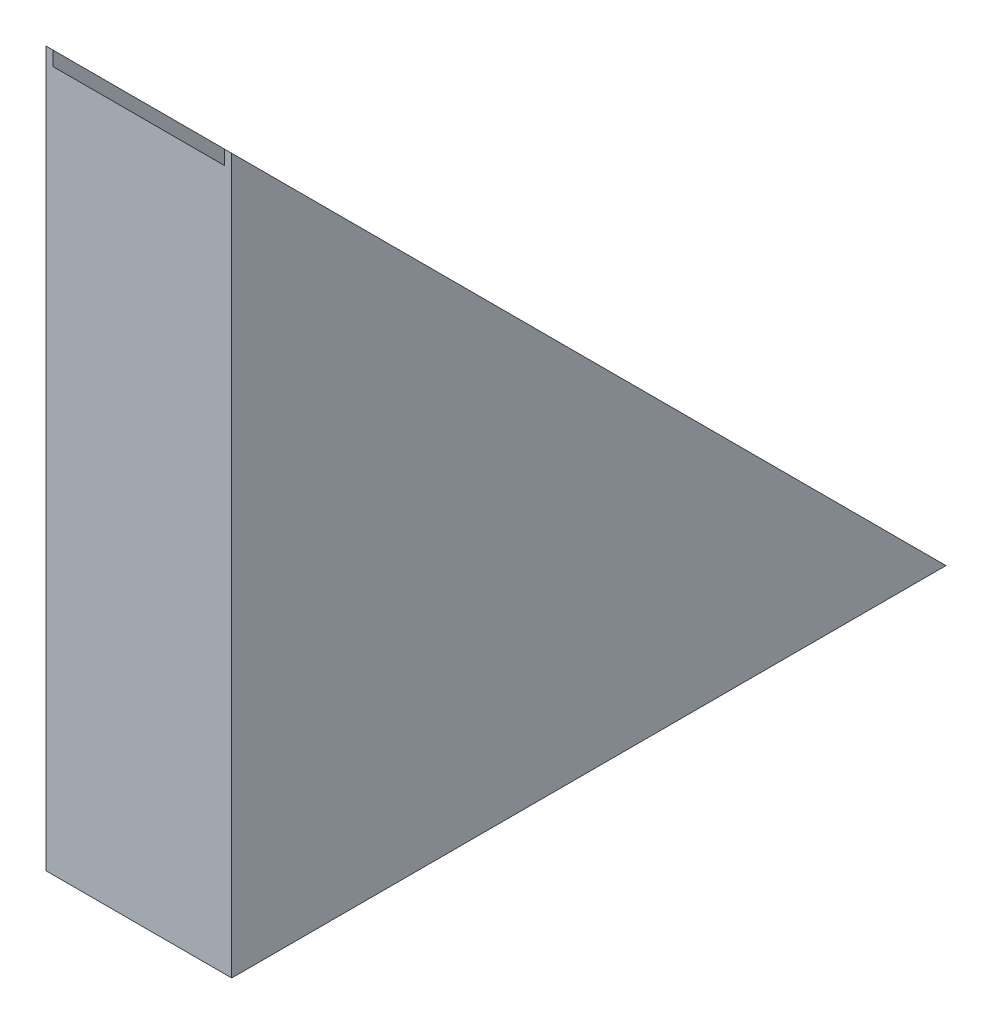
ISO-10303-21;
HEADER;
FILE_DESCRIPTION(('STEP AP214'),'2;1');
FILE_NAME('part.step','',(''),(''),'','','');
FILE_SCHEMA(('AUTOMOTIVE_DESIGN { 1 0 10303 214 1 1 1 1 }'));
ENDSEC;
DATA;
#1=APPLICATION_CONTEXT('core data for automotive mechanical design processes');
#2=APPLICATION_PROTOCOL_DEFINITION('international standard','automotive_design',2000,#1);
#3=PRODUCT_CONTEXT('',#1,'mechanical');
#4=PRODUCT('Part','Part','',(#3));
#5=PRODUCT_RELATED_PRODUCT_CATEGORY('part','',(#4));
#6=PRODUCT_DEFINITION_FORMATION('','',#4);
#7=PRODUCT_DEFINITION_CONTEXT('part definition',#1,'design');
#8=PRODUCT_DEFINITION('design','',#6,#7);
#9=PRODUCT_DEFINITION_SHAPE('','',#8);
#10=(LENGTH_UNIT() NAMED_UNIT(*) SI_UNIT(.MILLI.,.METRE.));
#11=(NAMED_UNIT(*) PLANE_ANGLE_UNIT() SI_UNIT($,.RADIAN.));
#12=(NAMED_UNIT(*) SI_UNIT($,.STERADIAN.) SOLID_ANGLE_UNIT());
#13=UNCERTAINTY_MEASURE_WITH_UNIT(LENGTH_MEASURE(1.E-05),#10,'distance_accuracy_value','');
#14=(GEOMETRIC_REPRESENTATION_CONTEXT(3) GLOBAL_UNCERTAINTY_ASSIGNED_CONTEXT((#13)) GLOBAL_UNIT_ASSIGNED_CONTEXT((#10,
#11,#12)) REPRESENTATION_CONTEXT('',''));
#15=CARTESIAN_POINT('',(0.,0.,0.));
#16=DIRECTION('',(0.,0.,1.));
#17=DIRECTION('',(1.,0.,0.));
#18=AXIS2_PLACEMENT_3D('',#15,#16,#17);
#19=CARTESIAN_POINT('',(650.,2500.,0.));
#20=DIRECTION('',(0.,-0.707106781186547,0.707106781186547));
#21=DIRECTION('',(0.,-0.707106781186548,-0.707106781186548));
#22=AXIS2_PLACEMENT_3D('',#19,#20,#21);
#23=PLANE('',#22);
#24=DIRECTION('',(-1.,0.,0.));
#25=VECTOR('',#24,1.);
#26=CARTESIAN_POINT('',(650.,2500.,0.));
#27=LINE('',#26,#25);
#28=CARTESIAN_POINT('',(25.,2500.,-2.22044604925031E-13));
#29=VERTEX_POINT('',#28);
#30=CARTESIAN_POINT('',(0.,2500.,0.));
#31=VERTEX_POINT('',#30);
#32=EDGE_CURVE('E75',#29,#31,#27,.T.);
#33=ORIENTED_EDGE('',*,*,#32,.F.);
#34=DIRECTION('',(0.,0.707106781186547,0.707106781186548));
#35=VECTOR('',#34,1.);
#36=CARTESIAN_POINT('',(25.,4.44089209850063E-13,-2500.));
#37=LINE('',#36,#35);
#38=CARTESIAN_POINT('',(25.,4.44089209850063E-13,-2500.));
#39=VERTEX_POINT('',#38);
#40=EDGE_CURVE('E103',#39,#29,#37,.T.);
#41=ORIENTED_EDGE('',*,*,#40,.F.);
#42=DIRECTION('',(-1.,0.,0.));
#43=VECTOR('',#42,1.);
#44=CARTESIAN_POINT('',(650.,0.,-2500.));
#45=LINE('',#44,#43);
#46=CARTESIAN_POINT('',(0.,0.,-2500.));
#47=VERTEX_POINT('',#46);
#48=EDGE_CURVE('E123',#39,#47,#45,.T.);
#49=ORIENTED_EDGE('',*,*,#48,.T.);
#50=DIRECTION('',(0.,0.707106781186547,0.707106781186547));
#51=VECTOR('',#50,1.);
#52=CARTESIAN_POINT('',(0.,2500.,0.));
#53=LINE('',#52,#51);
#54=EDGE_CURVE('E118',#47,#31,#53,.T.);
#55=ORIENTED_EDGE('',*,*,#54,.T.);
#56=EDGE_LOOP('',(#33,#41,#49,#55));
#57=FACE_BOUND('',#56,.T.);
#58=ADVANCED_FACE('F33',(#57),#23,.F.);
#59=CARTESIAN_POINT('',(650.,0.,0.));
#60=DIRECTION('',(0.,0.,-1.));
#61=DIRECTION('',(-1.,0.,0.));
#62=AXIS2_PLACEMENT_3D('',#59,#60,#61);
#63=PLANE('',#62);
#64=DIRECTION('',(-1.,0.,0.));
#65=VECTOR('',#64,1.);
#66=CARTESIAN_POINT('',(650.,2449.99340843449,0.));
#67=LINE('',#66,#65);
#68=CARTESIAN_POINT('',(625.,2449.99340843449,0.));
#69=VERTEX_POINT('',#68);
#70=CARTESIAN_POINT('',(25.,2449.99340843449,0.));
#71=VERTEX_POINT('',#70);
#72=EDGE_CURVE('E115',#69,#71,#67,.T.);
#73=ORIENTED_EDGE('',*,*,#72,.T.);
#74=DIRECTION('',(0.,1.,0.));
#75=VECTOR('',#74,1.);
#76=CARTESIAN_POINT('',(25.,0.,0.));
#77=LINE('',#76,#75);
#78=EDGE_CURVE('E106',#71,#29,#77,.T.);
#79=ORIENTED_EDGE('',*,*,#78,.T.);
#80=ORIENTED_EDGE('',*,*,#32,.T.);
#81=DIRECTION('',(0.,-1.,0.));
#82=VECTOR('',#81,1.);
#83=CARTESIAN_POINT('',(0.,0.,0.));
#84=LINE('',#83,#82);
#85=CARTESIAN_POINT('',(0.,0.,0.));
#86=VERTEX_POINT('',#85);
#87=EDGE_CURVE('E135',#31,#86,#84,.T.);
#88=ORIENTED_EDGE('',*,*,#87,.T.);
#89=DIRECTION('',(-1.,0.,0.));
#90=VECTOR('',#89,1.);
#91=CARTESIAN_POINT('',(650.,0.,0.));
#92=LINE('',#91,#90);
#93=CARTESIAN_POINT('',(650.,0.,0.));
#94=VERTEX_POINT('',#93);
#95=EDGE_CURVE('E41',#94,#86,#92,.T.);
#96=ORIENTED_EDGE('',*,*,#95,.F.);
#97=DIRECTION('',(0.,-1.,0.));
#98=VECTOR('',#97,1.);
#99=CARTESIAN_POINT('',(650.,0.,0.));
#100=LINE('',#99,#98);
#101=CARTESIAN_POINT('',(650.,2500.,0.));
#102=VERTEX_POINT('',#101);
#103=EDGE_CURVE('E141',#102,#94,#100,.T.);
#104=ORIENTED_EDGE('',*,*,#103,.F.);
#105=CARTESIAN_POINT('',(625.,2500.,0.));
#106=VERTEX_POINT('',#105);
#107=EDGE_CURVE('E120',#102,#106,#27,.T.);
#108=ORIENTED_EDGE('',*,*,#107,.T.);
#109=DIRECTION('',(0.,-1.,0.));
#110=VECTOR('',#109,1.);
#111=CARTESIAN_POINT('',(625.,0.,0.));
#112=LINE('',#111,#110);
#113=EDGE_CURVE('E48',#106,#69,#112,.T.);
#114=ORIENTED_EDGE('',*,*,#113,.T.);
#115=EDGE_LOOP('',(#73,#79,#80,#88,#96,#104,#108,#114));
#116=FACE_BOUND('',#115,.T.);
#117=ADVANCED_FACE('F35',(#116),#63,.F.);
#118=CARTESIAN_POINT('',(650.,0.,0.));
#119=DIRECTION('',(0.,1.,0.));
#120=DIRECTION('',(0.,0.,1.));
#121=AXIS2_PLACEMENT_3D('',#118,#119,#120);
#122=PLANE('',#121);
#123=ORIENTED_EDGE('',*,*,#48,.F.);
#124=DIRECTION('',(0.,0.,1.));
#125=VECTOR('',#124,1.);
#126=CARTESIAN_POINT('',(25.,0.,0.));
#127=LINE('',#126,#125);
#128=CARTESIAN_POINT('',(25.,-1.94289029309402E-13,-2449.99340843449));
#129=VERTEX_POINT('',#128);
#130=EDGE_CURVE('E109',#39,#129,#127,.T.);
#131=ORIENTED_EDGE('',*,*,#130,.T.);
#132=DIRECTION('',(1.,0.,0.));
#133=VECTOR('',#132,1.);
#134=CARTESIAN_POINT('',(650.,0.,-2449.99340843449));
#135=LINE('',#134,#133);
#136=CARTESIAN_POINT('',(625.,-1.94289029309402E-13,-2449.99340843449));
#137=VERTEX_POINT('',#136);
#138=EDGE_CURVE('E11',#129,#137,#135,.T.);
#139=ORIENTED_EDGE('',*,*,#138,.T.);
#140=DIRECTION('',(0.,0.,-1.));
#141=VECTOR('',#140,1.);
#142=CARTESIAN_POINT('',(625.,0.,0.));
#143=LINE('',#142,#141);
#144=CARTESIAN_POINT('',(625.,4.44089209850063E-13,-2500.));
#145=VERTEX_POINT('',#144);
#146=EDGE_CURVE('E145',#137,#145,#143,.T.);
#147=ORIENTED_EDGE('',*,*,#146,.T.);
#148=CARTESIAN_POINT('',(650.,0.,-2500.));
#149=VERTEX_POINT('',#148);
#150=EDGE_CURVE('E128',#149,#145,#45,.T.);
#151=ORIENTED_EDGE('',*,*,#150,.F.);
#152=DIRECTION('',(0.,0.,-1.));
#153=VECTOR('',#152,1.);
#154=CARTESIAN_POINT('',(650.,0.,0.));
#155=LINE('',#154,#153);
#156=EDGE_CURVE('E81',#94,#149,#155,.T.);
#157=ORIENTED_EDGE('',*,*,#156,.F.);
#158=ORIENTED_EDGE('',*,*,#95,.T.);
#159=DIRECTION('',(0.,0.,-1.));
#160=VECTOR('',#159,1.);
#161=CARTESIAN_POINT('',(0.,0.,0.));
#162=LINE('',#161,#160);
#163=EDGE_CURVE('E133',#86,#47,#162,.T.);
#164=ORIENTED_EDGE('',*,*,#163,.T.);
#165=EDGE_LOOP('',(#123,#131,#139,#147,#151,#157,#158,#164));
#166=FACE_BOUND('',#165,.T.);
#167=ADVANCED_FACE('F132',(#166),#122,.F.);
#168=ORIENTED_EDGE('',*,*,#150,.T.);
#169=DIRECTION('',(0.,-0.707106781186547,-0.707106781186548));
#170=VECTOR('',#169,1.);
#171=CARTESIAN_POINT('',(625.,4.44089209850063E-13,-2500.));
#172=LINE('',#171,#170);
#173=EDGE_CURVE('E112',#106,#145,#172,.T.);
#174=ORIENTED_EDGE('',*,*,#173,.F.);
#175=ORIENTED_EDGE('',*,*,#107,.F.);
#176=DIRECTION('',(0.,0.707106781186547,0.707106781186547));
#177=VECTOR('',#176,1.);
#178=CARTESIAN_POINT('',(650.,2500.,0.));
#179=LINE('',#178,#177);
#180=EDGE_CURVE('E57',#149,#102,#179,.T.);
#181=ORIENTED_EDGE('',*,*,#180,.F.);
#182=EDGE_LOOP('',(#168,#174,#175,#181));
#183=FACE_BOUND('',#182,.T.);
#184=ADVANCED_FACE('F156',(#183),#23,.F.);
#185=CARTESIAN_POINT('',(650.,0.,0.));
#186=DIRECTION('',(-1.,0.,0.));
#187=DIRECTION('',(0.,0.,1.));
#188=AXIS2_PLACEMENT_3D('',#185,#186,#187);
#189=PLANE('',#188);
#190=ORIENTED_EDGE('',*,*,#103,.T.);
#191=ORIENTED_EDGE('',*,*,#156,.T.);
#192=ORIENTED_EDGE('',*,*,#180,.T.);
#193=EDGE_LOOP('',(#190,#191,#192));
#194=FACE_BOUND('',#193,.T.);
#195=ADVANCED_FACE('F157',(#194),#189,.F.);
#196=CARTESIAN_POINT('',(0.,0.,0.));
#197=DIRECTION('',(-1.,0.,0.));
#198=DIRECTION('',(0.,0.,1.));
#199=AXIS2_PLACEMENT_3D('',#196,#197,#198);
#200=PLANE('',#199);
#201=ORIENTED_EDGE('',*,*,#87,.F.);
#202=ORIENTED_EDGE('',*,*,#54,.F.);
#203=ORIENTED_EDGE('',*,*,#163,.F.);
#204=EDGE_LOOP('',(#201,#202,#203));
#205=FACE_BOUND('',#204,.T.);
#206=ADVANCED_FACE('F159',(#205),#200,.T.);
#207=CARTESIAN_POINT('',(0.,1224.99670421724,-1224.99670421724));
#208=DIRECTION('',(0.,-0.707106781186548,0.707106781186547));
#209=DIRECTION('',(0.,-0.707106781186547,-0.707106781186548));
#210=AXIS2_PLACEMENT_3D('',#207,#208,#209);
#211=PLANE('',#210);
#212=DIRECTION('',(0.,-0.707106781186547,-0.707106781186548));
#213=VECTOR('',#212,1.);
#214=CARTESIAN_POINT('',(625.,-25.0032957827559,-2474.99670421724));
#215=LINE('',#214,#213);
#216=EDGE_CURVE('E148',#69,#137,#215,.T.);
#217=ORIENTED_EDGE('',*,*,#216,.T.);
#218=ORIENTED_EDGE('',*,*,#138,.F.);
#219=DIRECTION('',(0.,0.707106781186547,0.707106781186548));
#220=VECTOR('',#219,1.);
#221=CARTESIAN_POINT('',(25.,-25.0032957827559,-2474.99670421724));
#222=LINE('',#221,#220);
#223=EDGE_CURVE('E149',#129,#71,#222,.T.);
#224=ORIENTED_EDGE('',*,*,#223,.T.);
#225=ORIENTED_EDGE('',*,*,#72,.F.);
#226=EDGE_LOOP('',(#217,#218,#224,#225));
#227=FACE_BOUND('',#226,.T.);
#228=ADVANCED_FACE('F154',(#227),#211,.F.);
#229=CARTESIAN_POINT('',(25.,-25.0032957827559,-2474.99670421724));
#230=DIRECTION('',(-1.,0.,0.));
#231=DIRECTION('',(0.,0.,1.));
#232=AXIS2_PLACEMENT_3D('',#229,#230,#231);
#233=PLANE('',#232);
#234=ORIENTED_EDGE('',*,*,#223,.F.);
#235=ORIENTED_EDGE('',*,*,#130,.F.);
#236=ORIENTED_EDGE('',*,*,#40,.T.);
#237=ORIENTED_EDGE('',*,*,#78,.F.);
#238=EDGE_LOOP('',(#234,#235,#236,#237));
#239=FACE_BOUND('',#238,.T.);
#240=ADVANCED_FACE('F105',(#239),#233,.F.);
#241=CARTESIAN_POINT('',(625.,-25.0032957827559,-2474.99670421724));
#242=DIRECTION('',(1.,0.,0.));
#243=DIRECTION('',(0.,0.,-1.));
#244=AXIS2_PLACEMENT_3D('',#241,#242,#243);
#245=PLANE('',#244);
#246=ORIENTED_EDGE('',*,*,#173,.T.);
#247=ORIENTED_EDGE('',*,*,#146,.F.);
#248=ORIENTED_EDGE('',*,*,#216,.F.);
#249=ORIENTED_EDGE('',*,*,#113,.F.);
#250=EDGE_LOOP('',(#246,#247,#248,#249));
#251=FACE_BOUND('',#250,.T.);
#252=ADVANCED_FACE('F200',(#251),#245,.F.);
#253=CLOSED_SHELL('',(#58,#117,#167,#184,#195,#206,#228,#240,#252));
#254=MANIFOLD_SOLID_BREP('B2',#253);
#255=ADVANCED_BREP_SHAPE_REPRESENTATION('',(#18,#254),#14);
#256=SHAPE_DEFINITION_REPRESENTATION(#9,#255);
ENDSEC;
END-ISO-10303-21;
